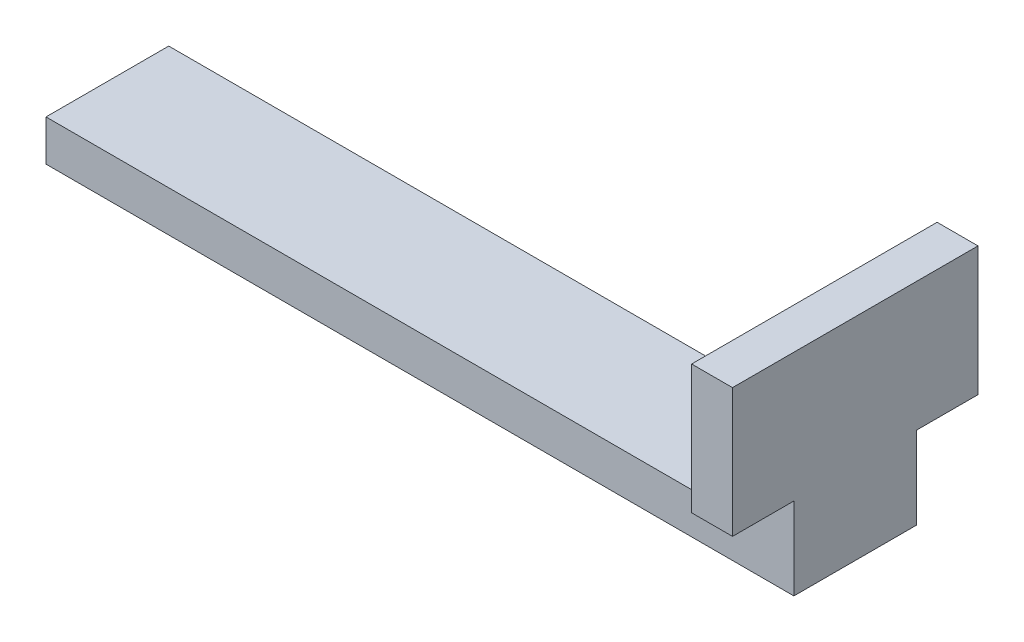
ISO-10303-21;
HEADER;
FILE_DESCRIPTION(('STEP AP214'),'2;1');
FILE_NAME('part.step','',(''),(''),'','','');
FILE_SCHEMA(('AUTOMOTIVE_DESIGN { 1 0 10303 214 1 1 1 1 }'));
ENDSEC;
DATA;
#1=APPLICATION_CONTEXT('core data for automotive mechanical design processes');
#2=APPLICATION_PROTOCOL_DEFINITION('international standard','automotive_design',2000,#1);
#3=PRODUCT_CONTEXT('',#1,'mechanical');
#4=PRODUCT('Part','Part','',(#3));
#5=PRODUCT_RELATED_PRODUCT_CATEGORY('part','',(#4));
#6=PRODUCT_DEFINITION_FORMATION('','',#4);
#7=PRODUCT_DEFINITION_CONTEXT('part definition',#1,'design');
#8=PRODUCT_DEFINITION('design','',#6,#7);
#9=PRODUCT_DEFINITION_SHAPE('','',#8);
#10=(LENGTH_UNIT() NAMED_UNIT(*) SI_UNIT(.MILLI.,.METRE.));
#11=(NAMED_UNIT(*) PLANE_ANGLE_UNIT() SI_UNIT($,.RADIAN.));
#12=(NAMED_UNIT(*) SI_UNIT($,.STERADIAN.) SOLID_ANGLE_UNIT());
#13=UNCERTAINTY_MEASURE_WITH_UNIT(LENGTH_MEASURE(1.E-05),#10,'distance_accuracy_value','');
#14=(GEOMETRIC_REPRESENTATION_CONTEXT(3) GLOBAL_UNCERTAINTY_ASSIGNED_CONTEXT((#13)) GLOBAL_UNIT_ASSIGNED_CONTEXT((#10,
#11,#12)) REPRESENTATION_CONTEXT('',''));
#15=CARTESIAN_POINT('',(0.,0.,0.));
#16=DIRECTION('',(0.,0.,1.));
#17=DIRECTION('',(1.,0.,0.));
#18=AXIS2_PLACEMENT_3D('',#15,#16,#17);
#19=CARTESIAN_POINT('',(-109.728,0.,9.525));
#20=DIRECTION('',(1.,0.,0.));
#21=DIRECTION('',(0.,0.,-1.));
#22=AXIS2_PLACEMENT_3D('',#19,#20,#21);
#23=PLANE('',#22);
#24=DIRECTION('',(0.,-1.,0.));
#25=VECTOR('',#24,1.);
#26=CARTESIAN_POINT('',(-109.728,0.,-9.525));
#27=LINE('',#26,#25);
#28=CARTESIAN_POINT('',(-109.728,6.35,-9.525));
#29=VERTEX_POINT('',#28);
#30=CARTESIAN_POINT('',(-109.728,0.,-9.525));
#31=VERTEX_POINT('',#30);
#32=EDGE_CURVE('E166',#29,#31,#27,.T.);
#33=ORIENTED_EDGE('',*,*,#32,.T.);
#34=DIRECTION('',(0.,0.,-1.));
#35=VECTOR('',#34,1.);
#36=CARTESIAN_POINT('',(-109.728,0.,9.525));
#37=LINE('',#36,#35);
#38=CARTESIAN_POINT('',(-109.728,0.,9.525));
#39=VERTEX_POINT('',#38);
#40=EDGE_CURVE('E47',#39,#31,#37,.T.);
#41=ORIENTED_EDGE('',*,*,#40,.F.);
#42=DIRECTION('',(0.,-1.,0.));
#43=VECTOR('',#42,1.);
#44=CARTESIAN_POINT('',(-109.728,0.,9.525));
#45=LINE('',#44,#43);
#46=CARTESIAN_POINT('',(-109.728,6.35,9.525));
#47=VERTEX_POINT('',#46);
#48=EDGE_CURVE('E167',#47,#39,#45,.T.);
#49=ORIENTED_EDGE('',*,*,#48,.F.);
#50=DIRECTION('',(0.,0.,-1.));
#51=VECTOR('',#50,1.);
#52=CARTESIAN_POINT('',(-109.728,6.35,9.525));
#53=LINE('',#52,#51);
#54=EDGE_CURVE('E183',#47,#29,#53,.T.);
#55=ORIENTED_EDGE('',*,*,#54,.T.);
#56=EDGE_LOOP('',(#33,#41,#49,#55));
#57=FACE_BOUND('',#56,.T.);
#58=ADVANCED_FACE('F39',(#57),#23,.F.);
#59=CARTESIAN_POINT('',(0.,0.,9.525));
#60=DIRECTION('',(0.,1.,0.));
#61=DIRECTION('',(0.,0.,1.));
#62=AXIS2_PLACEMENT_3D('',#59,#60,#61);
#63=PLANE('',#62);
#64=DIRECTION('',(1.,0.,0.));
#65=VECTOR('',#64,1.);
#66=CARTESIAN_POINT('',(0.,0.,-9.525));
#67=LINE('',#66,#65);
#68=CARTESIAN_POINT('',(6.35,0.,-9.525));
#69=VERTEX_POINT('',#68);
#70=EDGE_CURVE('E187',#31,#69,#67,.T.);
#71=ORIENTED_EDGE('',*,*,#70,.T.);
#72=DIRECTION('',(0.,0.,-1.));
#73=VECTOR('',#72,1.);
#74=CARTESIAN_POINT('',(6.35,0.,9.525));
#75=LINE('',#74,#73);
#76=CARTESIAN_POINT('',(6.35,0.,9.525));
#77=VERTEX_POINT('',#76);
#78=EDGE_CURVE('E211',#77,#69,#75,.T.);
#79=ORIENTED_EDGE('',*,*,#78,.F.);
#80=DIRECTION('',(1.,0.,0.));
#81=VECTOR('',#80,1.);
#82=CARTESIAN_POINT('',(-109.728,0.,9.525));
#83=LINE('',#82,#81);
#84=EDGE_CURVE('E171',#39,#77,#83,.T.);
#85=ORIENTED_EDGE('',*,*,#84,.F.);
#86=ORIENTED_EDGE('',*,*,#40,.T.);
#87=EDGE_LOOP('',(#71,#79,#85,#86));
#88=FACE_BOUND('',#87,.T.);
#89=ADVANCED_FACE('F218',(#88),#63,.F.);
#90=CARTESIAN_POINT('',(6.35,0.,9.525));
#91=DIRECTION('',(-1.,0.,0.));
#92=DIRECTION('',(0.,0.,1.));
#93=AXIS2_PLACEMENT_3D('',#90,#91,#92);
#94=PLANE('',#93);
#95=DIRECTION('',(0.,1.,0.));
#96=VECTOR('',#95,1.);
#97=CARTESIAN_POINT('',(6.35,0.,-9.525));
#98=LINE('',#97,#96);
#99=CARTESIAN_POINT('',(6.35,12.766,-9.525));
#100=VERTEX_POINT('',#99);
#101=EDGE_CURVE('E190',#69,#100,#98,.T.);
#102=ORIENTED_EDGE('',*,*,#101,.T.);
#103=DIRECTION('',(0.,0.,-1.));
#104=VECTOR('',#103,1.);
#105=CARTESIAN_POINT('',(6.35,12.766,-19.05));
#106=LINE('',#105,#104);
#107=CARTESIAN_POINT('',(6.35,12.766,-19.05));
#108=VERTEX_POINT('',#107);
#109=EDGE_CURVE('E163',#100,#108,#106,.T.);
#110=ORIENTED_EDGE('',*,*,#109,.T.);
#111=DIRECTION('',(0.,1.,0.));
#112=VECTOR('',#111,1.);
#113=CARTESIAN_POINT('',(6.35,32.766,-19.05));
#114=LINE('',#113,#112);
#115=CARTESIAN_POINT('',(6.35,32.766,-19.05));
#116=VERTEX_POINT('',#115);
#117=EDGE_CURVE('E121',#108,#116,#114,.T.);
#118=ORIENTED_EDGE('',*,*,#117,.T.);
#119=DIRECTION('',(0.,0.,-1.));
#120=VECTOR('',#119,1.);
#121=CARTESIAN_POINT('',(6.35,32.766,9.525));
#122=LINE('',#121,#120);
#123=CARTESIAN_POINT('',(6.35,32.766,19.05));
#124=VERTEX_POINT('',#123);
#125=EDGE_CURVE('E208',#124,#116,#122,.T.);
#126=ORIENTED_EDGE('',*,*,#125,.F.);
#127=DIRECTION('',(0.,-1.,0.));
#128=VECTOR('',#127,1.);
#129=CARTESIAN_POINT('',(6.35,32.766,19.05));
#130=LINE('',#129,#128);
#131=CARTESIAN_POINT('',(6.35,12.766,19.05));
#132=VERTEX_POINT('',#131);
#133=EDGE_CURVE('E151',#124,#132,#130,.T.);
#134=ORIENTED_EDGE('',*,*,#133,.T.);
#135=CARTESIAN_POINT('',(6.35,12.766,9.525));
#136=VERTEX_POINT('',#135);
#137=EDGE_CURVE('E159',#132,#136,#106,.T.);
#138=ORIENTED_EDGE('',*,*,#137,.T.);
#139=DIRECTION('',(0.,1.,0.));
#140=VECTOR('',#139,1.);
#141=CARTESIAN_POINT('',(6.35,0.,9.525));
#142=LINE('',#141,#140);
#143=EDGE_CURVE('E59',#77,#136,#142,.T.);
#144=ORIENTED_EDGE('',*,*,#143,.F.);
#145=ORIENTED_EDGE('',*,*,#78,.T.);
#146=EDGE_LOOP('',(#102,#110,#118,#126,#134,#138,#144,#145));
#147=FACE_BOUND('',#146,.T.);
#148=ADVANCED_FACE('F229',(#147),#94,.F.);
#149=CARTESIAN_POINT('',(0.,32.766,9.525));
#150=DIRECTION('',(0.,-1.,0.));
#151=DIRECTION('',(0.,0.,-1.));
#152=AXIS2_PLACEMENT_3D('',#149,#150,#151);
#153=PLANE('',#152);
#154=ORIENTED_EDGE('',*,*,#125,.T.);
#155=DIRECTION('',(-1.,0.,0.));
#156=VECTOR('',#155,1.);
#157=CARTESIAN_POINT('',(49.3803381348555,32.766,-19.05));
#158=LINE('',#157,#156);
#159=CARTESIAN_POINT('',(0.,32.766,-19.05));
#160=VERTEX_POINT('',#159);
#161=EDGE_CURVE('E148',#116,#160,#158,.T.);
#162=ORIENTED_EDGE('',*,*,#161,.T.);
#163=DIRECTION('',(0.,0.,-1.));
#164=VECTOR('',#163,1.);
#165=CARTESIAN_POINT('',(0.,32.766,9.525));
#166=LINE('',#165,#164);
#167=CARTESIAN_POINT('',(0.,32.766,19.05));
#168=VERTEX_POINT('',#167);
#169=EDGE_CURVE('E138',#168,#160,#166,.T.);
#170=ORIENTED_EDGE('',*,*,#169,.F.);
#171=DIRECTION('',(-1.,0.,0.));
#172=VECTOR('',#171,1.);
#173=CARTESIAN_POINT('',(49.3803381348555,32.766,19.05));
#174=LINE('',#173,#172);
#175=EDGE_CURVE('E152',#124,#168,#174,.T.);
#176=ORIENTED_EDGE('',*,*,#175,.F.);
#177=EDGE_LOOP('',(#154,#162,#170,#176));
#178=FACE_BOUND('',#177,.T.);
#179=ADVANCED_FACE('F249',(#178),#153,.F.);
#180=CARTESIAN_POINT('',(0.,6.35,9.525));
#181=DIRECTION('',(1.,0.,0.));
#182=DIRECTION('',(0.,0.,-1.));
#183=AXIS2_PLACEMENT_3D('',#180,#181,#182);
#184=PLANE('',#183);
#185=DIRECTION('',(0.,-1.,0.));
#186=VECTOR('',#185,1.);
#187=CARTESIAN_POINT('',(0.,6.35,9.525));
#188=LINE('',#187,#186);
#189=CARTESIAN_POINT('',(0.,12.766,9.525));
#190=VERTEX_POINT('',#189);
#191=CARTESIAN_POINT('',(0.,6.35,9.525));
#192=VERTEX_POINT('',#191);
#193=EDGE_CURVE('E177',#190,#192,#188,.T.);
#194=ORIENTED_EDGE('',*,*,#193,.F.);
#195=DIRECTION('',(0.,0.,1.));
#196=VECTOR('',#195,1.);
#197=CARTESIAN_POINT('',(0.,12.766,-19.05));
#198=LINE('',#197,#196);
#199=CARTESIAN_POINT('',(0.,12.766,19.05));
#200=VERTEX_POINT('',#199);
#201=EDGE_CURVE('E134',#190,#200,#198,.T.);
#202=ORIENTED_EDGE('',*,*,#201,.T.);
#203=DIRECTION('',(0.,1.,0.));
#204=VECTOR('',#203,1.);
#205=CARTESIAN_POINT('',(0.,32.766,19.05));
#206=LINE('',#205,#204);
#207=EDGE_CURVE('E125',#200,#168,#206,.T.);
#208=ORIENTED_EDGE('',*,*,#207,.T.);
#209=ORIENTED_EDGE('',*,*,#169,.T.);
#210=DIRECTION('',(0.,-1.,0.));
#211=VECTOR('',#210,1.);
#212=CARTESIAN_POINT('',(0.,32.766,-19.05));
#213=LINE('',#212,#211);
#214=CARTESIAN_POINT('',(0.,12.766,-19.05));
#215=VERTEX_POINT('',#214);
#216=EDGE_CURVE('E119',#160,#215,#213,.T.);
#217=ORIENTED_EDGE('',*,*,#216,.T.);
#218=CARTESIAN_POINT('',(0.,12.766,-9.525));
#219=VERTEX_POINT('',#218);
#220=EDGE_CURVE('E128',#215,#219,#198,.T.);
#221=ORIENTED_EDGE('',*,*,#220,.T.);
#222=DIRECTION('',(0.,-1.,0.));
#223=VECTOR('',#222,1.);
#224=CARTESIAN_POINT('',(0.,6.35,-9.525));
#225=LINE('',#224,#223);
#226=CARTESIAN_POINT('',(0.,6.35,-9.525));
#227=VERTEX_POINT('',#226);
#228=EDGE_CURVE('E194',#219,#227,#225,.T.);
#229=ORIENTED_EDGE('',*,*,#228,.T.);
#230=DIRECTION('',(0.,0.,-1.));
#231=VECTOR('',#230,1.);
#232=CARTESIAN_POINT('',(0.,6.35,9.525));
#233=LINE('',#232,#231);
#234=EDGE_CURVE('E202',#192,#227,#233,.T.);
#235=ORIENTED_EDGE('',*,*,#234,.F.);
#236=EDGE_LOOP('',(#194,#202,#208,#209,#217,#221,#229,#235));
#237=FACE_BOUND('',#236,.T.);
#238=ADVANCED_FACE('F136',(#237),#184,.F.);
#239=CARTESIAN_POINT('',(-109.728,6.35,9.525));
#240=DIRECTION('',(0.,-1.,0.));
#241=DIRECTION('',(0.,0.,-1.));
#242=AXIS2_PLACEMENT_3D('',#239,#240,#241);
#243=PLANE('',#242);
#244=DIRECTION('',(-1.,0.,0.));
#245=VECTOR('',#244,1.);
#246=CARTESIAN_POINT('',(-109.728,6.35,-9.525));
#247=LINE('',#246,#245);
#248=EDGE_CURVE('E172',#227,#29,#247,.T.);
#249=ORIENTED_EDGE('',*,*,#248,.T.);
#250=ORIENTED_EDGE('',*,*,#54,.F.);
#251=DIRECTION('',(-1.,0.,0.));
#252=VECTOR('',#251,1.);
#253=CARTESIAN_POINT('',(-109.728,6.35,9.525));
#254=LINE('',#253,#252);
#255=EDGE_CURVE('E180',#192,#47,#254,.T.);
#256=ORIENTED_EDGE('',*,*,#255,.F.);
#257=ORIENTED_EDGE('',*,*,#234,.T.);
#258=EDGE_LOOP('',(#249,#250,#256,#257));
#259=FACE_BOUND('',#258,.T.);
#260=ADVANCED_FACE('F241',(#259),#243,.F.);
#261=CARTESIAN_POINT('',(0.,0.,9.525));
#262=DIRECTION('',(0.,0.,-1.));
#263=DIRECTION('',(-1.,0.,0.));
#264=AXIS2_PLACEMENT_3D('',#261,#262,#263);
#265=PLANE('',#264);
#266=ORIENTED_EDGE('',*,*,#143,.T.);
#267=DIRECTION('',(-1.,0.,0.));
#268=VECTOR('',#267,1.);
#269=CARTESIAN_POINT('',(0.,12.766,9.525));
#270=LINE('',#269,#268);
#271=EDGE_CURVE('E54',#136,#190,#270,.T.);
#272=ORIENTED_EDGE('',*,*,#271,.T.);
#273=ORIENTED_EDGE('',*,*,#193,.T.);
#274=ORIENTED_EDGE('',*,*,#255,.T.);
#275=ORIENTED_EDGE('',*,*,#48,.T.);
#276=ORIENTED_EDGE('',*,*,#84,.T.);
#277=EDGE_LOOP('',(#266,#272,#273,#274,#275,#276));
#278=FACE_BOUND('',#277,.T.);
#279=ADVANCED_FACE('F239',(#278),#265,.F.);
#280=CARTESIAN_POINT('',(0.,0.,-9.525));
#281=DIRECTION('',(0.,0.,-1.));
#282=DIRECTION('',(-1.,0.,0.));
#283=AXIS2_PLACEMENT_3D('',#280,#281,#282);
#284=PLANE('',#283);
#285=DIRECTION('',(-1.,0.,0.));
#286=VECTOR('',#285,1.);
#287=CARTESIAN_POINT('',(0.,12.766,-9.525));
#288=LINE('',#287,#286);
#289=EDGE_CURVE('E11',#100,#219,#288,.T.);
#290=ORIENTED_EDGE('',*,*,#289,.F.);
#291=ORIENTED_EDGE('',*,*,#101,.F.);
#292=ORIENTED_EDGE('',*,*,#70,.F.);
#293=ORIENTED_EDGE('',*,*,#32,.F.);
#294=ORIENTED_EDGE('',*,*,#248,.F.);
#295=ORIENTED_EDGE('',*,*,#228,.F.);
#296=EDGE_LOOP('',(#290,#291,#292,#293,#294,#295));
#297=FACE_BOUND('',#296,.T.);
#298=ADVANCED_FACE('F226',(#297),#284,.T.);
#299=CARTESIAN_POINT('',(49.3803381348555,32.766,-19.05));
#300=DIRECTION('',(0.,0.,-1.));
#301=DIRECTION('',(0.,1.,0.));
#302=AXIS2_PLACEMENT_3D('',#299,#300,#301);
#303=PLANE('',#302);
#304=ORIENTED_EDGE('',*,*,#117,.F.);
#305=DIRECTION('',(-1.,0.,0.));
#306=VECTOR('',#305,1.);
#307=CARTESIAN_POINT('',(49.3803381348555,12.766,-19.05));
#308=LINE('',#307,#306);
#309=EDGE_CURVE('E114',#108,#215,#308,.T.);
#310=ORIENTED_EDGE('',*,*,#309,.T.);
#311=ORIENTED_EDGE('',*,*,#216,.F.);
#312=ORIENTED_EDGE('',*,*,#161,.F.);
#313=EDGE_LOOP('',(#304,#310,#311,#312));
#314=FACE_BOUND('',#313,.T.);
#315=ADVANCED_FACE('F116',(#314),#303,.T.);
#316=CARTESIAN_POINT('',(49.3803381348555,12.766,-19.05));
#317=DIRECTION('',(0.,-1.,0.));
#318=DIRECTION('',(0.,0.,-1.));
#319=AXIS2_PLACEMENT_3D('',#316,#317,#318);
#320=PLANE('',#319);
#321=ORIENTED_EDGE('',*,*,#109,.F.);
#322=ORIENTED_EDGE('',*,*,#289,.T.);
#323=ORIENTED_EDGE('',*,*,#220,.F.);
#324=ORIENTED_EDGE('',*,*,#309,.F.);
#325=EDGE_LOOP('',(#321,#322,#323,#324));
#326=FACE_BOUND('',#325,.T.);
#327=ADVANCED_FACE('F129',(#326),#320,.T.);
#328=ORIENTED_EDGE('',*,*,#271,.F.);
#329=ORIENTED_EDGE('',*,*,#137,.F.);
#330=DIRECTION('',(-1.,0.,0.));
#331=VECTOR('',#330,1.);
#332=CARTESIAN_POINT('',(49.3803381348555,12.766,19.05));
#333=LINE('',#332,#331);
#334=EDGE_CURVE('E124',#132,#200,#333,.T.);
#335=ORIENTED_EDGE('',*,*,#334,.T.);
#336=ORIENTED_EDGE('',*,*,#201,.F.);
#337=EDGE_LOOP('',(#328,#329,#335,#336));
#338=FACE_BOUND('',#337,.T.);
#339=ADVANCED_FACE('F234',(#338),#320,.T.);
#340=CARTESIAN_POINT('',(49.3803381348555,32.766,19.05));
#341=DIRECTION('',(0.,0.,1.));
#342=DIRECTION('',(0.,-1.,0.));
#343=AXIS2_PLACEMENT_3D('',#340,#341,#342);
#344=PLANE('',#343);
#345=ORIENTED_EDGE('',*,*,#133,.F.);
#346=ORIENTED_EDGE('',*,*,#175,.T.);
#347=ORIENTED_EDGE('',*,*,#207,.F.);
#348=ORIENTED_EDGE('',*,*,#334,.F.);
#349=EDGE_LOOP('',(#345,#346,#347,#348));
#350=FACE_BOUND('',#349,.T.);
#351=ADVANCED_FACE('F270',(#350),#344,.T.);
#352=CLOSED_SHELL('',(#58,#89,#148,#179,#238,#260,#279,#298,#315,#327,#339,#351));
#353=MANIFOLD_SOLID_BREP('B2',#352);
#354=ADVANCED_BREP_SHAPE_REPRESENTATION('',(#18,#353),#14);
#355=SHAPE_DEFINITION_REPRESENTATION(#9,#354);
ENDSEC;
END-ISO-10303-21;
